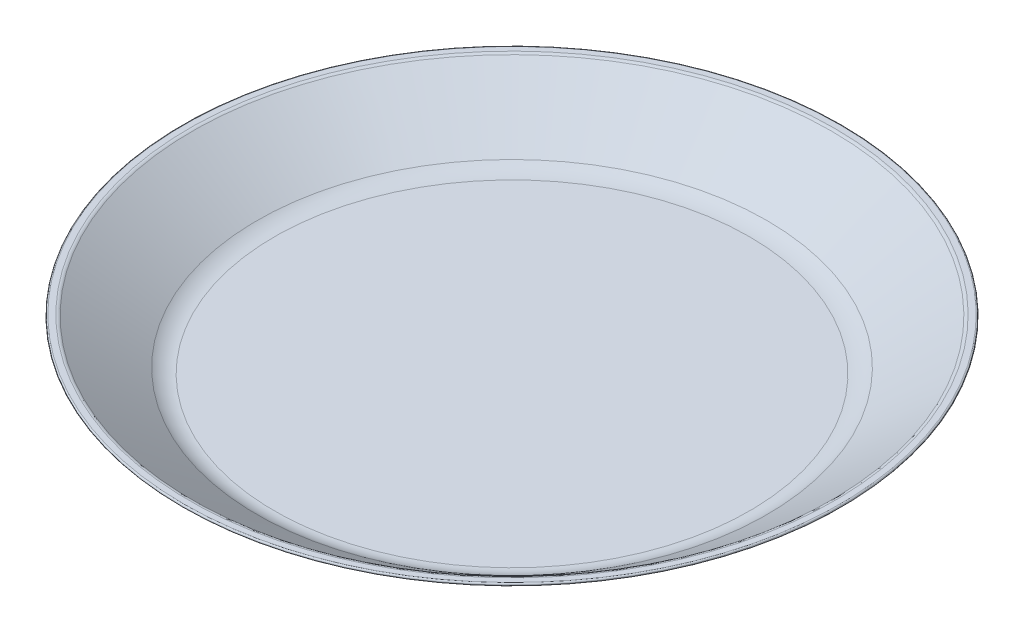
ISO-10303-21;
HEADER;
FILE_DESCRIPTION(('STEP AP214'),'2;1');
FILE_NAME('part.step','',(''),(''),'','','');
FILE_SCHEMA(('AUTOMOTIVE_DESIGN { 1 0 10303 214 1 1 1 1 }'));
ENDSEC;
DATA;
#1=APPLICATION_CONTEXT('core data for automotive mechanical design processes');
#2=APPLICATION_PROTOCOL_DEFINITION('international standard','automotive_design',2000,#1);
#3=PRODUCT_CONTEXT('',#1,'mechanical');
#4=PRODUCT('Part','Part','',(#3));
#5=PRODUCT_RELATED_PRODUCT_CATEGORY('part','',(#4));
#6=PRODUCT_DEFINITION_FORMATION('','',#4);
#7=PRODUCT_DEFINITION_CONTEXT('part definition',#1,'design');
#8=PRODUCT_DEFINITION('design','',#6,#7);
#9=PRODUCT_DEFINITION_SHAPE('','',#8);
#10=(LENGTH_UNIT() NAMED_UNIT(*) SI_UNIT(.MILLI.,.METRE.));
#11=(NAMED_UNIT(*) PLANE_ANGLE_UNIT() SI_UNIT($,.RADIAN.));
#12=(NAMED_UNIT(*) SI_UNIT($,.STERADIAN.) SOLID_ANGLE_UNIT());
#13=UNCERTAINTY_MEASURE_WITH_UNIT(LENGTH_MEASURE(1.E-05),#10,'distance_accuracy_value','');
#14=(GEOMETRIC_REPRESENTATION_CONTEXT(3) GLOBAL_UNCERTAINTY_ASSIGNED_CONTEXT((#13)) GLOBAL_UNIT_ASSIGNED_CONTEXT((#10,
#11,#12)) REPRESENTATION_CONTEXT('',''));
#15=CARTESIAN_POINT('',(0.,0.,0.));
#16=DIRECTION('',(0.,0.,1.));
#17=DIRECTION('',(1.,0.,0.));
#18=AXIS2_PLACEMENT_3D('',#15,#16,#17);
#19=CARTESIAN_POINT('',(0.,2.5,0.));
#20=DIRECTION('',(0.,1.,0.));
#21=DIRECTION('',(0.,0.,1.));
#22=AXIS2_PLACEMENT_3D('',#19,#20,#21);
#23=PLANE('',#22);
#24=CARTESIAN_POINT('',(0.,2.5,0.));
#25=DIRECTION('',(0.,-1.,0.));
#26=DIRECTION('',(0.,0.,-1.));
#27=AXIS2_PLACEMENT_3D('',#24,#25,#26);
#28=CIRCLE('',#27,90.0935782776924);
#29=CARTESIAN_POINT('',(0.,2.5,-90.0935782776924));
#30=VERTEX_POINT('',#29);
#31=EDGE_CURVE('E10',#30,#30,#28,.T.);
#32=ORIENTED_EDGE('',*,*,#31,.F.);
#33=EDGE_LOOP('',(#32));
#34=FACE_BOUND('',#33,.T.);
#35=ADVANCED_FACE('F31',(#34),#23,.T.);
#36=CARTESIAN_POINT('',(0.,14.,0.));
#37=DIRECTION('',(0.,-1.,0.));
#38=DIRECTION('',(0.,0.,-1.));
#39=AXIS2_PLACEMENT_3D('',#36,#37,#38);
#40=TOROIDAL_SURFACE('',#39,90.0935782776924,11.5);
#41=ORIENTED_EDGE('',*,*,#31,.T.);
#42=EDGE_LOOP('',(#41));
#43=FACE_BOUND('',#42,.T.);
#44=CARTESIAN_POINT('',(0.,4.5613074217323,0.));
#45=DIRECTION('',(0.,-1.,0.));
#46=DIRECTION('',(0.,0.,-1.));
#47=AXIS2_PLACEMENT_3D('',#44,#45,#46);
#48=CIRCLE('',#47,96.6632877395296);
#49=CARTESIAN_POINT('',(0.,4.5613074217323,-96.6632877395296));
#50=VERTEX_POINT('',#49);
#51=EDGE_CURVE('E37',#50,#50,#48,.T.);
#52=ORIENTED_EDGE('',*,*,#51,.F.);
#53=EDGE_LOOP('',(#52));
#54=FACE_BOUND('',#53,.T.);
#55=ADVANCED_FACE('F79',(#43,#54),#40,.F.);
#56=CARTESIAN_POINT('',(0.,21.6415117527422,0.));
#57=DIRECTION('',(0.,1.,0.));
#58=DIRECTION('',(0.,0.,1.));
#59=AXIS2_PLACEMENT_3D('',#56,#57,#58);
#60=CONICAL_SURFACE('',#59,121.202393888877,0.962732893724117);
#61=ORIENTED_EDGE('',*,*,#51,.T.);
#62=EDGE_LOOP('',(#61));
#63=FACE_BOUND('',#62,.T.);
#64=CARTESIAN_POINT('',(0.,21.6415117527422,0.));
#65=DIRECTION('',(0.,-1.,0.));
#66=DIRECTION('',(0.,0.,-1.));
#67=AXIS2_PLACEMENT_3D('',#64,#65,#66);
#68=CIRCLE('',#67,121.202393888877);
#69=CARTESIAN_POINT('',(0.,21.6415117527422,-121.202393888877));
#70=VERTEX_POINT('',#69);
#71=EDGE_CURVE('E41',#70,#70,#68,.T.);
#72=ORIENTED_EDGE('',*,*,#71,.F.);
#73=EDGE_LOOP('',(#72));
#74=FACE_BOUND('',#73,.T.);
#75=ADVANCED_FACE('F84',(#63,#74),#60,.F.);
#76=CARTESIAN_POINT('',(0.,20.,0.));
#77=DIRECTION('',(0.,-1.,0.));
#78=DIRECTION('',(0.,0.,-1.));
#79=AXIS2_PLACEMENT_3D('',#76,#77,#78);
#80=TOROIDAL_SURFACE('',#79,122.344952056153,2.);
#81=ORIENTED_EDGE('',*,*,#71,.T.);
#82=EDGE_LOOP('',(#81));
#83=FACE_BOUND('',#82,.T.);
#84=CARTESIAN_POINT('',(0.,22.,0.));
#85=DIRECTION('',(0.,-1.,0.));
#86=DIRECTION('',(0.,0.,-1.));
#87=AXIS2_PLACEMENT_3D('',#84,#85,#86);
#88=CIRCLE('',#87,122.344952056153);
#89=CARTESIAN_POINT('',(0.,22.,-122.344952056153));
#90=VERTEX_POINT('',#89);
#91=EDGE_CURVE('E45',#90,#90,#88,.T.);
#92=ORIENTED_EDGE('',*,*,#91,.F.);
#93=EDGE_LOOP('',(#92));
#94=FACE_BOUND('',#93,.T.);
#95=ADVANCED_FACE('F88',(#83,#94),#80,.T.);
#96=CARTESIAN_POINT('',(124.5,22.,0.));
#97=DIRECTION('',(0.,1.,0.));
#98=DIRECTION('',(0.,0.,1.));
#99=AXIS2_PLACEMENT_3D('',#96,#97,#98);
#100=PLANE('',#99);
#101=ORIENTED_EDGE('',*,*,#91,.T.);
#102=EDGE_LOOP('',(#101));
#103=FACE_BOUND('',#102,.T.);
#104=CARTESIAN_POINT('',(0.,22.,0.));
#105=DIRECTION('',(0.,-1.,0.));
#106=DIRECTION('',(0.,0.,-1.));
#107=AXIS2_PLACEMENT_3D('',#104,#105,#106);
#108=CIRCLE('',#107,124.5);
#109=CARTESIAN_POINT('',(0.,22.,-124.5));
#110=VERTEX_POINT('',#109);
#111=EDGE_CURVE('E50',#110,#110,#108,.T.);
#112=ORIENTED_EDGE('',*,*,#111,.F.);
#113=EDGE_LOOP('',(#112));
#114=FACE_BOUND('',#113,.T.);
#115=ADVANCED_FACE('F94',(#103,#114),#100,.T.);
#116=CARTESIAN_POINT('',(0.,21.5,0.));
#117=DIRECTION('',(0.,-1.,0.));
#118=DIRECTION('',(0.,0.,-1.));
#119=AXIS2_PLACEMENT_3D('',#116,#117,#118);
#120=TOROIDAL_SURFACE('',#119,124.5,0.499999999999998);
#121=ORIENTED_EDGE('',*,*,#111,.T.);
#122=EDGE_LOOP('',(#121));
#123=FACE_BOUND('',#122,.T.);
#124=CARTESIAN_POINT('',(0.,21.0896220618145,0.));
#125=DIRECTION('',(0.,-1.,0.));
#126=DIRECTION('',(0.,0.,-1.));
#127=AXIS2_PLACEMENT_3D('',#124,#125,#126);
#128=CIRCLE('',#127,124.785639541819);
#129=CARTESIAN_POINT('',(0.,21.0896220618145,-124.785639541819));
#130=VERTEX_POINT('',#129);
#131=EDGE_CURVE('E53',#130,#130,#128,.T.);
#132=ORIENTED_EDGE('',*,*,#131,.F.);
#133=EDGE_LOOP('',(#132));
#134=FACE_BOUND('',#133,.T.);
#135=ADVANCED_FACE('F75',(#123,#134),#120,.T.);
#136=CARTESIAN_POINT('',(0.,2.50941773080454,0.));
#137=DIRECTION('',(0.,1.,0.));
#138=DIRECTION('',(0.,0.,1.));
#139=AXIS2_PLACEMENT_3D('',#136,#137,#138);
#140=CONICAL_SURFACE('',#139,98.0914854486247,0.962732893724117);
#141=ORIENTED_EDGE('',*,*,#131,.T.);
#142=EDGE_LOOP('',(#141));
#143=FACE_BOUND('',#142,.T.);
#144=CARTESIAN_POINT('',(0.,2.50941773080454,0.));
#145=DIRECTION('',(0.,-1.,0.));
#146=DIRECTION('',(0.,0.,-1.));
#147=AXIS2_PLACEMENT_3D('',#144,#145,#146);
#148=CIRCLE('',#147,98.0914854486247);
#149=CARTESIAN_POINT('',(0.,2.50941773080454,-98.0914854486247));
#150=VERTEX_POINT('',#149);
#151=EDGE_CURVE('E56',#150,#150,#148,.T.);
#152=ORIENTED_EDGE('',*,*,#151,.F.);
#153=EDGE_LOOP('',(#152));
#154=FACE_BOUND('',#153,.T.);
#155=ADVANCED_FACE('F67',(#143,#154),#140,.T.);
#156=CARTESIAN_POINT('',(0.,14.,0.));
#157=DIRECTION('',(0.,-1.,0.));
#158=DIRECTION('',(0.,0.,-1.));
#159=AXIS2_PLACEMENT_3D('',#156,#157,#158);
#160=TOROIDAL_SURFACE('',#159,90.0935782776924,14.);
#161=ORIENTED_EDGE('',*,*,#151,.T.);
#162=EDGE_LOOP('',(#161));
#163=FACE_BOUND('',#162,.T.);
#164=CARTESIAN_POINT('',(0.,0.,0.));
#165=DIRECTION('',(0.,-1.,0.));
#166=DIRECTION('',(0.,0.,-1.));
#167=AXIS2_PLACEMENT_3D('',#164,#165,#166);
#168=CIRCLE('',#167,90.0935782776924);
#169=CARTESIAN_POINT('',(0.,0.,-90.0935782776924));
#170=VERTEX_POINT('',#169);
#171=EDGE_CURVE('E59',#170,#170,#168,.T.);
#172=ORIENTED_EDGE('',*,*,#171,.F.);
#173=EDGE_LOOP('',(#172));
#174=FACE_BOUND('',#173,.T.);
#175=ADVANCED_FACE('F65',(#163,#174),#160,.T.);
#176=CARTESIAN_POINT('',(0.,0.,0.));
#177=DIRECTION('',(0.,-1.,0.));
#178=DIRECTION('',(0.,0.,-1.));
#179=AXIS2_PLACEMENT_3D('',#176,#177,#178);
#180=PLANE('',#179);
#181=ORIENTED_EDGE('',*,*,#171,.T.);
#182=EDGE_LOOP('',(#181));
#183=FACE_BOUND('',#182,.T.);
#184=ADVANCED_FACE('F63',(#183),#180,.T.);
#185=CLOSED_SHELL('',(#35,#55,#75,#95,#115,#135,#155,#175,#184));
#186=MANIFOLD_SOLID_BREP('B2',#185);
#187=ADVANCED_BREP_SHAPE_REPRESENTATION('',(#18,#186),#14);
#188=SHAPE_DEFINITION_REPRESENTATION(#9,#187);
ENDSEC;
END-ISO-10303-21;
